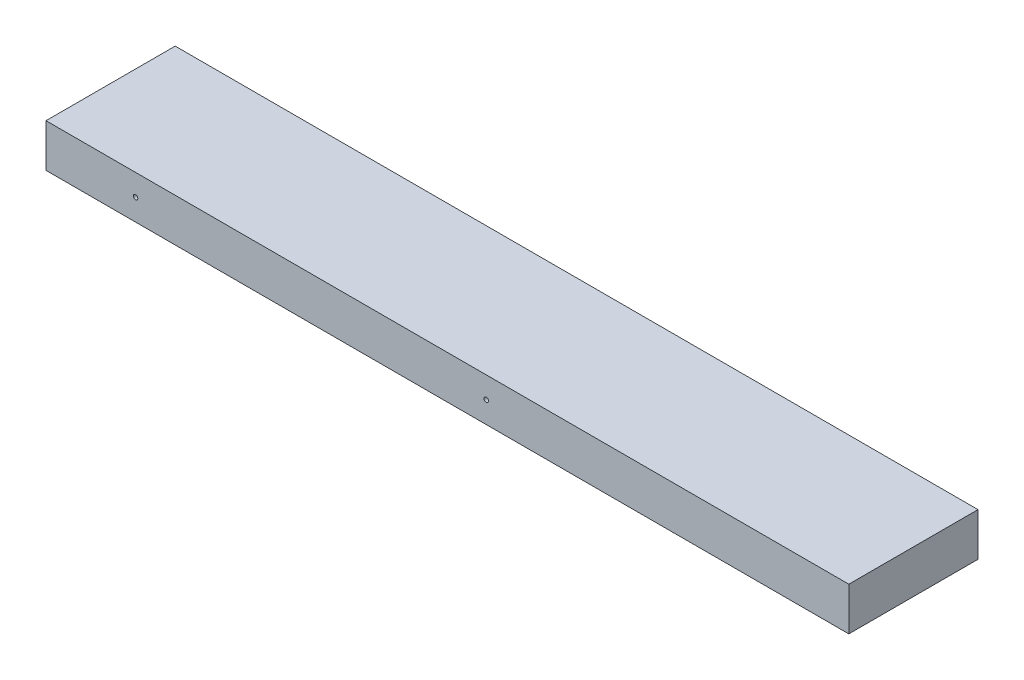
ISO-10303-21;
HEADER;
FILE_DESCRIPTION(('STEP AP214'),'2;1');
FILE_NAME('part.step','',(''),(''),'','','');
FILE_SCHEMA(('AUTOMOTIVE_DESIGN { 1 0 10303 214 1 1 1 1 }'));
ENDSEC;
DATA;
#1=APPLICATION_CONTEXT('core data for automotive mechanical design processes');
#2=APPLICATION_PROTOCOL_DEFINITION('international standard','automotive_design',2000,#1);
#3=PRODUCT_CONTEXT('',#1,'mechanical');
#4=PRODUCT('Part','Part','',(#3));
#5=PRODUCT_RELATED_PRODUCT_CATEGORY('part','',(#4));
#6=PRODUCT_DEFINITION_FORMATION('','',#4);
#7=PRODUCT_DEFINITION_CONTEXT('part definition',#1,'design');
#8=PRODUCT_DEFINITION('design','',#6,#7);
#9=PRODUCT_DEFINITION_SHAPE('','',#8);
#10=(LENGTH_UNIT() NAMED_UNIT(*) SI_UNIT(.MILLI.,.METRE.));
#11=(NAMED_UNIT(*) PLANE_ANGLE_UNIT() SI_UNIT($,.RADIAN.));
#12=(NAMED_UNIT(*) SI_UNIT($,.STERADIAN.) SOLID_ANGLE_UNIT());
#13=UNCERTAINTY_MEASURE_WITH_UNIT(LENGTH_MEASURE(1.E-05),#10,'distance_accuracy_value','');
#14=(GEOMETRIC_REPRESENTATION_CONTEXT(3) GLOBAL_UNCERTAINTY_ASSIGNED_CONTEXT((#13)) GLOBAL_UNIT_ASSIGNED_CONTEXT((#10,
#11,#12)) REPRESENTATION_CONTEXT('',''));
#15=CARTESIAN_POINT('',(0.,0.,0.));
#16=DIRECTION('',(0.,0.,1.));
#17=DIRECTION('',(1.,0.,0.));
#18=AXIS2_PLACEMENT_3D('',#15,#16,#17);
#19=CARTESIAN_POINT('',(86.3599999999993,5213.35,2683.51));
#20=DIRECTION('',(0.,-1.,0.));
#21=DIRECTION('',(0.,0.,-1.));
#22=AXIS2_PLACEMENT_3D('',#19,#20,#21);
#23=PLANE('',#22);
#24=DIRECTION('',(0.,0.,-1.));
#25=VECTOR('',#24,1.);
#26=CARTESIAN_POINT('',(90.1229654482429,5213.35,2740.66));
#27=LINE('',#26,#25);
#28=CARTESIAN_POINT('',(90.1229654482429,5213.35,2740.66));
#29=VERTEX_POINT('',#28);
#30=CARTESIAN_POINT('',(90.1229654482434,5213.35,2683.51));
#31=VERTEX_POINT('',#30);
#32=EDGE_CURVE('E101',#29,#31,#27,.T.);
#33=ORIENTED_EDGE('',*,*,#32,.T.);
#34=DIRECTION('',(1.,0.,0.));
#35=VECTOR('',#34,1.);
#36=CARTESIAN_POINT('',(265.81557086487,5213.35,2683.51));
#37=LINE('',#36,#35);
#38=CARTESIAN_POINT('',(445.271141729742,5213.35,2683.51));
#39=VERTEX_POINT('',#38);
#40=EDGE_CURVE('E107',#31,#39,#37,.T.);
#41=ORIENTED_EDGE('',*,*,#40,.T.);
#42=DIRECTION('',(0.,0.,-1.));
#43=VECTOR('',#42,1.);
#44=CARTESIAN_POINT('',(445.271141729742,5213.35,2683.51));
#45=LINE('',#44,#43);
#46=CARTESIAN_POINT('',(445.271141729743,5213.35,2740.66));
#47=VERTEX_POINT('',#46);
#48=EDGE_CURVE('E118',#47,#39,#45,.T.);
#49=ORIENTED_EDGE('',*,*,#48,.F.);
#50=DIRECTION('',(-1.,0.,0.));
#51=VECTOR('',#50,1.);
#52=CARTESIAN_POINT('',(265.81557086487,5213.35,2740.66));
#53=LINE('',#52,#51);
#54=EDGE_CURVE('E80',#47,#29,#53,.T.);
#55=ORIENTED_EDGE('',*,*,#54,.T.);
#56=EDGE_LOOP('',(#33,#41,#49,#55));
#57=FACE_BOUND('',#56,.T.);
#58=ADVANCED_FACE('F40',(#57),#23,.T.);
#59=CARTESIAN_POINT('',(265.815570864871,5222.875,2740.66));
#60=DIRECTION('',(0.,0.,-1.));
#61=DIRECTION('',(-1.,0.,0.));
#62=AXIS2_PLACEMENT_3D('',#59,#60,#61);
#63=PLANE('',#62);
#64=CARTESIAN_POINT('',(129.745749031468,5222.875,2740.66));
#65=DIRECTION('',(0.,0.,-1.));
#66=DIRECTION('',(-1.,0.,0.));
#67=AXIS2_PLACEMENT_3D('',#64,#65,#66);
#68=CIRCLE('',#67,0.991870000000006);
#69=CARTESIAN_POINT('',(128.753879031468,5222.875,2740.66));
#70=VERTEX_POINT('',#69);
#71=EDGE_CURVE('E43',#70,#70,#68,.T.);
#72=ORIENTED_EDGE('',*,*,#71,.T.);
#73=EDGE_LOOP('',(#72));
#74=FACE_BOUND('',#73,.T.);
#75=CARTESIAN_POINT('',(284.876857239857,5222.875,2740.66));
#76=DIRECTION('',(0.,0.,-1.));
#77=DIRECTION('',(-1.,0.,0.));
#78=AXIS2_PLACEMENT_3D('',#75,#76,#77);
#79=CIRCLE('',#78,0.991870000000006);
#80=CARTESIAN_POINT('',(283.884987239857,5222.875,2740.66));
#81=VERTEX_POINT('',#80);
#82=EDGE_CURVE('E122',#81,#81,#79,.T.);
#83=ORIENTED_EDGE('',*,*,#82,.T.);
#84=EDGE_LOOP('',(#83));
#85=FACE_BOUND('',#84,.T.);
#86=DIRECTION('',(1.,0.,0.));
#87=VECTOR('',#86,1.);
#88=CARTESIAN_POINT('',(445.271141729742,5232.4,2740.66));
#89=LINE('',#88,#87);
#90=CARTESIAN_POINT('',(90.1229654482434,5232.4,2740.66));
#91=VERTEX_POINT('',#90);
#92=CARTESIAN_POINT('',(445.271141729743,5232.4,2740.66));
#93=VERTEX_POINT('',#92);
#94=EDGE_CURVE('E110',#91,#93,#89,.T.);
#95=ORIENTED_EDGE('',*,*,#94,.F.);
#96=DIRECTION('',(0.,-1.,0.));
#97=VECTOR('',#96,1.);
#98=CARTESIAN_POINT('',(90.1229654482429,5213.35,2740.66));
#99=LINE('',#98,#97);
#100=EDGE_CURVE('E56',#91,#29,#99,.T.);
#101=ORIENTED_EDGE('',*,*,#100,.T.);
#102=ORIENTED_EDGE('',*,*,#54,.F.);
#103=DIRECTION('',(0.,1.,0.));
#104=VECTOR('',#103,1.);
#105=CARTESIAN_POINT('',(445.271141729741,5213.35,2740.66));
#106=LINE('',#105,#104);
#107=EDGE_CURVE('E120',#93,#47,#106,.F.);
#108=ORIENTED_EDGE('',*,*,#107,.F.);
#109=EDGE_LOOP('',(#95,#101,#102,#108));
#110=FACE_BOUND('',#109,.T.);
#111=ADVANCED_FACE('F136',(#74,#85,#110),#63,.F.);
#112=CARTESIAN_POINT('',(445.271141729742,5213.35,2683.51));
#113=DIRECTION('',(1.,0.,0.));
#114=DIRECTION('',(0.,0.,-1.));
#115=AXIS2_PLACEMENT_3D('',#112,#113,#114);
#116=PLANE('',#115);
#117=DIRECTION('',(0.,1.,0.));
#118=VECTOR('',#117,1.);
#119=CARTESIAN_POINT('',(445.271141729742,5222.875,2683.51));
#120=LINE('',#119,#118);
#121=CARTESIAN_POINT('',(445.271141729742,5232.4,2683.51));
#122=VERTEX_POINT('',#121);
#123=EDGE_CURVE('E65',#39,#122,#120,.T.);
#124=ORIENTED_EDGE('',*,*,#123,.T.);
#125=DIRECTION('',(0.,0.,1.));
#126=VECTOR('',#125,1.);
#127=CARTESIAN_POINT('',(445.271141729742,5232.4,2683.51));
#128=LINE('',#127,#126);
#129=EDGE_CURVE('E48',#93,#122,#128,.F.);
#130=ORIENTED_EDGE('',*,*,#129,.F.);
#131=ORIENTED_EDGE('',*,*,#107,.T.);
#132=ORIENTED_EDGE('',*,*,#48,.T.);
#133=EDGE_LOOP('',(#124,#130,#131,#132));
#134=FACE_BOUND('',#133,.T.);
#135=ADVANCED_FACE('F138',(#134),#116,.T.);
#136=CARTESIAN_POINT('',(265.81557086487,5222.875,2683.51));
#137=DIRECTION('',(0.,0.,1.));
#138=DIRECTION('',(1.,0.,0.));
#139=AXIS2_PLACEMENT_3D('',#136,#137,#138);
#140=PLANE('',#139);
#141=ORIENTED_EDGE('',*,*,#40,.F.);
#142=DIRECTION('',(0.,-1.,0.));
#143=VECTOR('',#142,1.);
#144=CARTESIAN_POINT('',(90.1229654482434,5213.35,2683.51));
#145=LINE('',#144,#143);
#146=CARTESIAN_POINT('',(90.1229654482433,5232.4,2683.51));
#147=VERTEX_POINT('',#146);
#148=EDGE_CURVE('E97',#147,#31,#145,.T.);
#149=ORIENTED_EDGE('',*,*,#148,.F.);
#150=DIRECTION('',(1.,0.,0.));
#151=VECTOR('',#150,1.);
#152=CARTESIAN_POINT('',(445.271141729742,5232.4,2683.51));
#153=LINE('',#152,#151);
#154=EDGE_CURVE('E11',#122,#147,#153,.F.);
#155=ORIENTED_EDGE('',*,*,#154,.F.);
#156=ORIENTED_EDGE('',*,*,#123,.F.);
#157=EDGE_LOOP('',(#141,#149,#155,#156));
#158=FACE_BOUND('',#157,.T.);
#159=ADVANCED_FACE('F105',(#158),#140,.F.);
#160=CARTESIAN_POINT('',(445.271141729742,5232.4,2683.51));
#161=DIRECTION('',(0.,1.,0.));
#162=DIRECTION('',(0.,0.,1.));
#163=AXIS2_PLACEMENT_3D('',#160,#161,#162);
#164=PLANE('',#163);
#165=DIRECTION('',(0.,0.,-1.));
#166=VECTOR('',#165,1.);
#167=CARTESIAN_POINT('',(90.1229654482434,5232.4,2740.66));
#168=LINE('',#167,#166);
#169=EDGE_CURVE('E94',#91,#147,#168,.T.);
#170=ORIENTED_EDGE('',*,*,#169,.F.);
#171=ORIENTED_EDGE('',*,*,#94,.T.);
#172=ORIENTED_EDGE('',*,*,#129,.T.);
#173=ORIENTED_EDGE('',*,*,#154,.T.);
#174=EDGE_LOOP('',(#170,#171,#172,#173));
#175=FACE_BOUND('',#174,.T.);
#176=ADVANCED_FACE('F109',(#175),#164,.T.);
#177=CARTESIAN_POINT('',(284.876857239855,5222.875,2759.71000000001));
#178=DIRECTION('',(0.,0.,1.));
#179=DIRECTION('',(1.,0.,0.));
#180=AXIS2_PLACEMENT_3D('',#177,#178,#179);
#181=CYLINDRICAL_SURFACE('',#180,0.991870000000006);
#182=CARTESIAN_POINT('',(284.876857239855,5222.875,2721.61000000001));
#183=DIRECTION('',(0.,0.,1.));
#184=DIRECTION('',(1.,0.,0.));
#185=AXIS2_PLACEMENT_3D('',#182,#183,#184);
#186=CIRCLE('',#185,0.991870000000006);
#187=CARTESIAN_POINT('',(285.868727239855,5222.875,2721.61000000001));
#188=VERTEX_POINT('',#187);
#189=EDGE_CURVE('E124',#188,#188,#186,.T.);
#190=ORIENTED_EDGE('',*,*,#189,.F.);
#191=EDGE_LOOP('',(#190));
#192=FACE_BOUND('',#191,.T.);
#193=ORIENTED_EDGE('',*,*,#82,.F.);
#194=EDGE_LOOP('',(#193));
#195=FACE_BOUND('',#194,.T.);
#196=ADVANCED_FACE('F148',(#192,#195),#181,.F.);
#197=CARTESIAN_POINT('',(284.876857239855,5222.875,2721.61000000001));
#198=DIRECTION('',(0.,0.,1.));
#199=DIRECTION('',(1.,0.,0.));
#200=AXIS2_PLACEMENT_3D('',#197,#198,#199);
#201=CONICAL_SURFACE('',#200,0.991870000000006,1.02974425867677);
#202=CARTESIAN_POINT('',(284.876857239857,5222.875,2721.01402437781));
#203=VERTEX_POINT('',#202);
#204=VERTEX_LOOP('',#203);
#205=FACE_BOUND('',#204,.T.);
#206=ORIENTED_EDGE('',*,*,#189,.T.);
#207=EDGE_LOOP('',(#206));
#208=FACE_BOUND('',#207,.T.);
#209=ADVANCED_FACE('F153',(#205,#208),#201,.F.);
#210=CARTESIAN_POINT('',(129.745749031468,5222.875,2759.71));
#211=DIRECTION('',(0.,0.,1.));
#212=DIRECTION('',(1.,0.,0.));
#213=AXIS2_PLACEMENT_3D('',#210,#211,#212);
#214=CYLINDRICAL_SURFACE('',#213,0.991870000000006);
#215=CARTESIAN_POINT('',(129.745749031468,5222.875,2721.61000000001));
#216=DIRECTION('',(0.,0.,1.));
#217=DIRECTION('',(1.,0.,0.));
#218=AXIS2_PLACEMENT_3D('',#215,#216,#217);
#219=CIRCLE('',#218,0.991870000000006);
#220=CARTESIAN_POINT('',(130.737619031468,5222.875,2721.61000000001));
#221=VERTEX_POINT('',#220);
#222=EDGE_CURVE('E131',#221,#221,#219,.T.);
#223=ORIENTED_EDGE('',*,*,#222,.F.);
#224=EDGE_LOOP('',(#223));
#225=FACE_BOUND('',#224,.T.);
#226=ORIENTED_EDGE('',*,*,#71,.F.);
#227=EDGE_LOOP('',(#226));
#228=FACE_BOUND('',#227,.T.);
#229=ADVANCED_FACE('F158',(#225,#228),#214,.F.);
#230=CARTESIAN_POINT('',(129.745749031468,5222.875,2721.61000000001));
#231=DIRECTION('',(0.,0.,1.));
#232=DIRECTION('',(1.,0.,0.));
#233=AXIS2_PLACEMENT_3D('',#230,#231,#232);
#234=CONICAL_SURFACE('',#233,0.991870000000006,1.02974425867677);
#235=CARTESIAN_POINT('',(129.745749031468,5222.875,2721.01402437781));
#236=VERTEX_POINT('',#235);
#237=VERTEX_LOOP('',#236);
#238=FACE_BOUND('',#237,.T.);
#239=ORIENTED_EDGE('',*,*,#222,.T.);
#240=EDGE_LOOP('',(#239));
#241=FACE_BOUND('',#240,.T.);
#242=ADVANCED_FACE('F160',(#238,#241),#234,.F.);
#243=CARTESIAN_POINT('',(90.1229654482429,5213.35,2740.66));
#244=DIRECTION('',(1.,0.,0.));
#245=DIRECTION('',(0.,0.,-1.));
#246=AXIS2_PLACEMENT_3D('',#243,#244,#245);
#247=PLANE('',#246);
#248=ORIENTED_EDGE('',*,*,#148,.T.);
#249=ORIENTED_EDGE('',*,*,#32,.F.);
#250=ORIENTED_EDGE('',*,*,#100,.F.);
#251=ORIENTED_EDGE('',*,*,#169,.T.);
#252=EDGE_LOOP('',(#248,#249,#250,#251));
#253=FACE_BOUND('',#252,.T.);
#254=ADVANCED_FACE('F96',(#253),#247,.F.);
#255=CLOSED_SHELL('',(#58,#111,#135,#159,#176,#196,#209,#229,#242,#254));
#256=MANIFOLD_SOLID_BREP('B2',#255);
#257=ADVANCED_BREP_SHAPE_REPRESENTATION('',(#18,#256),#14);
#258=SHAPE_DEFINITION_REPRESENTATION(#9,#257);
ENDSEC;
END-ISO-10303-21;
